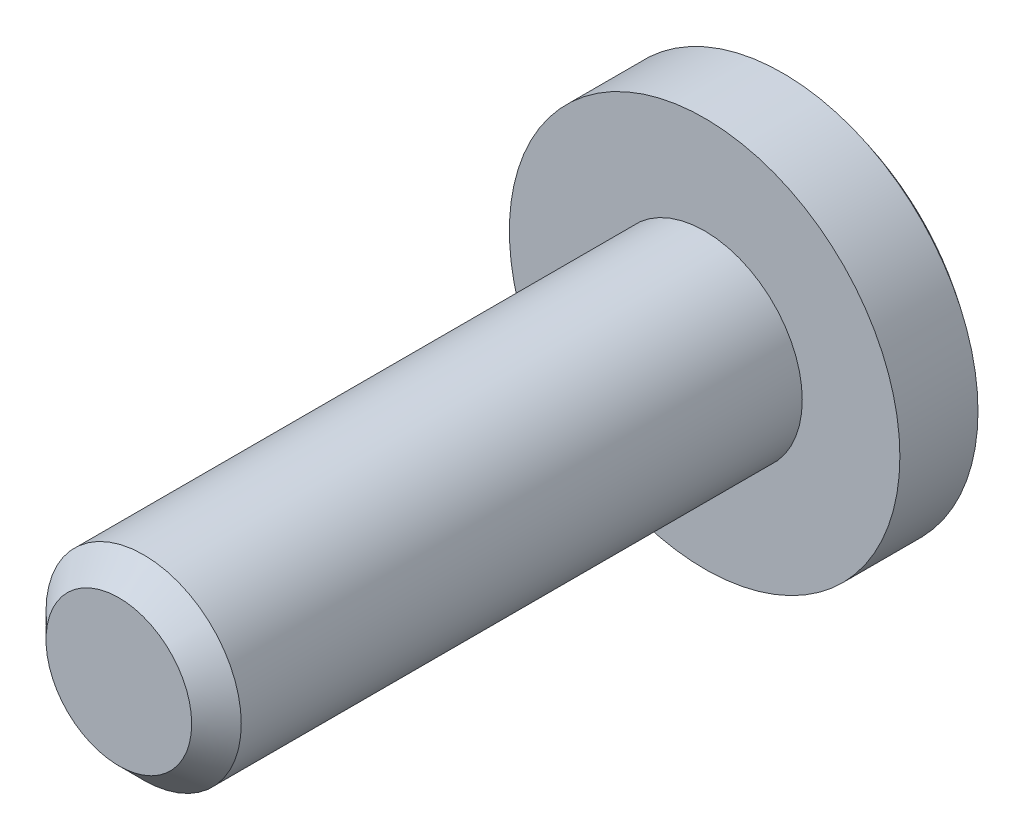
ISO-10303-21;
HEADER;
FILE_DESCRIPTION(('STEP AP214'),'2;1');
FILE_NAME('part.step','',(''),(''),'','','');
FILE_SCHEMA(('AUTOMOTIVE_DESIGN { 1 0 10303 214 1 1 1 1 }'));
ENDSEC;
DATA;
#1=APPLICATION_CONTEXT('core data for automotive mechanical design processes');
#2=APPLICATION_PROTOCOL_DEFINITION('international standard','automotive_design',2000,#1);
#3=PRODUCT_CONTEXT('',#1,'mechanical');
#4=PRODUCT('Part','Part','',(#3));
#5=PRODUCT_RELATED_PRODUCT_CATEGORY('part','',(#4));
#6=PRODUCT_DEFINITION_FORMATION('','',#4);
#7=PRODUCT_DEFINITION_CONTEXT('part definition',#1,'design');
#8=PRODUCT_DEFINITION('design','',#6,#7);
#9=PRODUCT_DEFINITION_SHAPE('','',#8);
#10=(LENGTH_UNIT() NAMED_UNIT(*) SI_UNIT(.MILLI.,.METRE.));
#11=(NAMED_UNIT(*) PLANE_ANGLE_UNIT() SI_UNIT($,.RADIAN.));
#12=(NAMED_UNIT(*) SI_UNIT($,.STERADIAN.) SOLID_ANGLE_UNIT());
#13=UNCERTAINTY_MEASURE_WITH_UNIT(LENGTH_MEASURE(1.E-05),#10,'distance_accuracy_value','');
#14=(GEOMETRIC_REPRESENTATION_CONTEXT(3) GLOBAL_UNCERTAINTY_ASSIGNED_CONTEXT((#13)) GLOBAL_UNIT_ASSIGNED_CONTEXT((#10,
#11,#12)) REPRESENTATION_CONTEXT('',''));
#15=CARTESIAN_POINT('',(0.,0.,0.));
#16=DIRECTION('',(0.,0.,1.));
#17=DIRECTION('',(1.,0.,0.));
#18=AXIS2_PLACEMENT_3D('',#15,#16,#17);
#19=CARTESIAN_POINT('',(0.3,-1.27,-6.8));
#20=DIRECTION('',(1.,0.,0.));
#21=DIRECTION('',(0.,0.,-1.));
#22=AXIS2_PLACEMENT_3D('',#19,#20,#21);
#23=PLANE('',#22);
#24=CARTESIAN_POINT('',(0.3,0.,-4.29285714285715));
#25=DIRECTION('',(1.,0.,0.));
#26=DIRECTION('',(0.,0.,-1.));
#27=AXIS2_PLACEMENT_3D('',#24,#25,#26);
#28=CIRCLE('',#27,3.19308084866675);
#29=CARTESIAN_POINT('',(0.3,1.27,-7.22250990489609));
#30=VERTEX_POINT('',#29);
#31=CARTESIAN_POINT('',(0.3,0.294469512293891,-7.47233084340128));
#32=VERTEX_POINT('',#31);
#33=EDGE_CURVE('E239',#30,#32,#28,.F.);
#34=ORIENTED_EDGE('',*,*,#33,.T.);
#35=DIRECTION('',(0.,0.,1.));
#36=VECTOR('',#35,1.);
#37=CARTESIAN_POINT('',(0.3,0.294469512293891,-6.8));
#38=LINE('',#37,#36);
#39=CARTESIAN_POINT('',(0.3,0.294469512293891,-6.8));
#40=VERTEX_POINT('',#39);
#41=EDGE_CURVE('E182',#32,#40,#38,.T.);
#42=ORIENTED_EDGE('',*,*,#41,.T.);
#43=DIRECTION('',(0.,1.,0.));
#44=VECTOR('',#43,1.);
#45=CARTESIAN_POINT('',(0.3,-1.27,-6.8));
#46=LINE('',#45,#44);
#47=CARTESIAN_POINT('',(0.3,1.27,-6.8));
#48=VERTEX_POINT('',#47);
#49=EDGE_CURVE('E216',#40,#48,#46,.T.);
#50=ORIENTED_EDGE('',*,*,#49,.T.);
#51=DIRECTION('',(0.,0.,-1.));
#52=VECTOR('',#51,1.);
#53=CARTESIAN_POINT('',(0.3,1.27,-6.8));
#54=LINE('',#53,#52);
#55=EDGE_CURVE('E200',#48,#30,#54,.T.);
#56=ORIENTED_EDGE('',*,*,#55,.T.);
#57=EDGE_LOOP('',(#34,#42,#50,#56));
#58=FACE_BOUND('',#57,.T.);
#59=ADVANCED_FACE('F40',(#58),#23,.F.);
#60=CARTESIAN_POINT('',(-0.3,-1.27,-6.8));
#61=DIRECTION('',(-1.,0.,0.));
#62=DIRECTION('',(0.,0.,1.));
#63=AXIS2_PLACEMENT_3D('',#60,#61,#62);
#64=PLANE('',#63);
#65=DIRECTION('',(0.,1.,0.));
#66=VECTOR('',#65,1.);
#67=CARTESIAN_POINT('',(-0.3,-1.27,-6.8));
#68=LINE('',#67,#66);
#69=CARTESIAN_POINT('',(-0.3,0.294469512293891,-6.8));
#70=VERTEX_POINT('',#69);
#71=CARTESIAN_POINT('',(-0.3,1.27,-6.8));
#72=VERTEX_POINT('',#71);
#73=EDGE_CURVE('E199',#70,#72,#68,.T.);
#74=ORIENTED_EDGE('',*,*,#73,.F.);
#75=DIRECTION('',(0.,0.,-1.));
#76=VECTOR('',#75,1.);
#77=CARTESIAN_POINT('',(-0.3,0.294469512293891,-6.8));
#78=LINE('',#77,#76);
#79=CARTESIAN_POINT('',(-0.3,0.294469512293891,-7.47233084340128));
#80=VERTEX_POINT('',#79);
#81=EDGE_CURVE('E250',#70,#80,#78,.T.);
#82=ORIENTED_EDGE('',*,*,#81,.T.);
#83=CARTESIAN_POINT('',(-0.3,0.,-4.29285714285715));
#84=DIRECTION('',(-1.,0.,0.));
#85=DIRECTION('',(0.,0.,1.));
#86=AXIS2_PLACEMENT_3D('',#83,#84,#85);
#87=CIRCLE('',#86,3.19308084866675);
#88=CARTESIAN_POINT('',(-0.3,1.27,-7.22250990489609));
#89=VERTEX_POINT('',#88);
#90=EDGE_CURVE('E233',#80,#89,#87,.F.);
#91=ORIENTED_EDGE('',*,*,#90,.T.);
#92=DIRECTION('',(0.,0.,1.));
#93=VECTOR('',#92,1.);
#94=CARTESIAN_POINT('',(-0.3,1.27,-6.8));
#95=LINE('',#94,#93);
#96=EDGE_CURVE('E204',#89,#72,#95,.T.);
#97=ORIENTED_EDGE('',*,*,#96,.T.);
#98=EDGE_LOOP('',(#74,#82,#91,#97));
#99=FACE_BOUND('',#98,.T.);
#100=ADVANCED_FACE('F276',(#99),#64,.F.);
#101=CARTESIAN_POINT('',(0.,0.,-4.29285714285715));
#102=DIRECTION('',(0.,0.,1.));
#103=DIRECTION('',(1.,0.,0.));
#104=AXIS2_PLACEMENT_3D('',#101,#102,#103);
#105=SPHERICAL_SURFACE('',#104,3.20714285714285);
#106=CARTESIAN_POINT('',(0.,0.294469512293891,-4.29285714285715));
#107=DIRECTION('',(0.,1.,0.));
#108=DIRECTION('',(0.,0.,1.));
#109=AXIS2_PLACEMENT_3D('',#106,#107,#108);
#110=CIRCLE('',#109,3.19359562444148);
#111=CARTESIAN_POINT('',(-1.27,0.294469512293891,-7.22307095970598));
#112=VERTEX_POINT('',#111);
#113=EDGE_CURVE('E179',#112,#80,#110,.F.);
#114=ORIENTED_EDGE('',*,*,#113,.F.);
#115=CARTESIAN_POINT('',(-1.27,0.,-4.29285714285715));
#116=DIRECTION('',(1.,0.,0.));
#117=DIRECTION('',(0.,0.,-1.));
#118=AXIS2_PLACEMENT_3D('',#115,#116,#117);
#119=CIRCLE('',#118,2.94497288716253);
#120=CARTESIAN_POINT('',(-1.27,-0.294469512293891,-7.22307095970598));
#121=VERTEX_POINT('',#120);
#122=EDGE_CURVE('E257',#112,#121,#119,.F.);
#123=ORIENTED_EDGE('',*,*,#122,.T.);
#124=CARTESIAN_POINT('',(0.,-0.294469512293891,-4.29285714285715));
#125=DIRECTION('',(0.,-1.,0.));
#126=DIRECTION('',(0.,0.,-1.));
#127=AXIS2_PLACEMENT_3D('',#124,#125,#126);
#128=CIRCLE('',#127,3.19359562444148);
#129=CARTESIAN_POINT('',(-0.3,-0.294469512293891,-7.47233084340128));
#130=VERTEX_POINT('',#129);
#131=EDGE_CURVE('E146',#130,#121,#128,.F.);
#132=ORIENTED_EDGE('',*,*,#131,.F.);
#133=CARTESIAN_POINT('',(-0.3,-1.27,-7.22250990489609));
#134=VERTEX_POINT('',#133);
#135=EDGE_CURVE('E234',#134,#130,#87,.F.);
#136=ORIENTED_EDGE('',*,*,#135,.F.);
#137=CARTESIAN_POINT('',(0.,-1.27,-4.29285714285715));
#138=DIRECTION('',(0.,1.,0.));
#139=DIRECTION('',(0.,0.,1.));
#140=AXIS2_PLACEMENT_3D('',#137,#138,#139);
#141=CIRCLE('',#140,2.94497288716253);
#142=CARTESIAN_POINT('',(0.3,-1.27,-7.22250990489609));
#143=VERTEX_POINT('',#142);
#144=EDGE_CURVE('E243',#134,#143,#141,.F.);
#145=ORIENTED_EDGE('',*,*,#144,.T.);
#146=CARTESIAN_POINT('',(0.3,-0.294469512293891,-7.47233084340128));
#147=VERTEX_POINT('',#146);
#148=EDGE_CURVE('E238',#147,#143,#28,.F.);
#149=ORIENTED_EDGE('',*,*,#148,.F.);
#150=CARTESIAN_POINT('',(1.27,-0.294469512293891,-7.22307095970598));
#151=VERTEX_POINT('',#150);
#152=EDGE_CURVE('E56',#151,#147,#128,.F.);
#153=ORIENTED_EDGE('',*,*,#152,.F.);
#154=CARTESIAN_POINT('',(1.27,0.,-4.29285714285715));
#155=DIRECTION('',(1.,0.,0.));
#156=DIRECTION('',(0.,0.,-1.));
#157=AXIS2_PLACEMENT_3D('',#154,#155,#156);
#158=CIRCLE('',#157,2.94497288716253);
#159=CARTESIAN_POINT('',(1.27,0.294469512293891,-7.22307095970598));
#160=VERTEX_POINT('',#159);
#161=EDGE_CURVE('E254',#160,#151,#158,.F.);
#162=ORIENTED_EDGE('',*,*,#161,.F.);
#163=EDGE_CURVE('E183',#32,#160,#110,.F.);
#164=ORIENTED_EDGE('',*,*,#163,.F.);
#165=ORIENTED_EDGE('',*,*,#33,.F.);
#166=CARTESIAN_POINT('',(0.,1.27,-4.29285714285715));
#167=DIRECTION('',(0.,1.,0.));
#168=DIRECTION('',(0.,0.,1.));
#169=AXIS2_PLACEMENT_3D('',#166,#167,#168);
#170=CIRCLE('',#169,2.94497288716253);
#171=EDGE_CURVE('E230',#89,#30,#170,.F.);
#172=ORIENTED_EDGE('',*,*,#171,.F.);
#173=ORIENTED_EDGE('',*,*,#90,.F.);
#174=EDGE_LOOP('',(#114,#123,#132,#136,#145,#149,#153,#162,#164,#165,#172,#173));
#175=FACE_BOUND('',#174,.T.);
#176=CARTESIAN_POINT('',(0.,0.,-6.8));
#177=DIRECTION('',(0.,0.,1.));
#178=DIRECTION('',(1.,0.,0.));
#179=AXIS2_PLACEMENT_3D('',#176,#177,#178);
#180=CIRCLE('',#179,2.);
#181=CARTESIAN_POINT('',(2.,0.,-6.8));
#182=VERTEX_POINT('',#181);
#183=EDGE_CURVE('E215',#182,#182,#180,.T.);
#184=ORIENTED_EDGE('',*,*,#183,.F.);
#185=EDGE_LOOP('',(#184));
#186=FACE_BOUND('',#185,.T.);
#187=ADVANCED_FACE('F283',(#175,#186),#105,.T.);
#188=CARTESIAN_POINT('',(0.,0.,0.));
#189=DIRECTION('',(0.,0.,1.));
#190=DIRECTION('',(1.,0.,0.));
#191=AXIS2_PLACEMENT_3D('',#188,#189,#190);
#192=PLANE('',#191);
#193=CARTESIAN_POINT('',(0.,0.,0.));
#194=DIRECTION('',(0.,0.,1.));
#195=DIRECTION('',(1.,0.,0.));
#196=AXIS2_PLACEMENT_3D('',#193,#194,#195);
#197=CIRCLE('',#196,0.746000000000001);
#198=CARTESIAN_POINT('',(0.746000000000001,0.,0.));
#199=VERTEX_POINT('',#198);
#200=EDGE_CURVE('E49',#199,#199,#197,.T.);
#201=ORIENTED_EDGE('',*,*,#200,.T.);
#202=EDGE_LOOP('',(#201));
#203=FACE_BOUND('',#202,.T.);
#204=ADVANCED_FACE('F263',(#203),#192,.T.);
#205=CARTESIAN_POINT('',(0.,0.,0.));
#206=DIRECTION('',(0.,0.,1.));
#207=DIRECTION('',(1.,0.,0.));
#208=AXIS2_PLACEMENT_3D('',#205,#206,#207);
#209=CYLINDRICAL_SURFACE('',#208,1.);
#210=CARTESIAN_POINT('',(0.,0.,-0.254));
#211=DIRECTION('',(0.,0.,1.));
#212=DIRECTION('',(1.,0.,0.));
#213=AXIS2_PLACEMENT_3D('',#210,#211,#212);
#214=CIRCLE('',#213,1.);
#215=CARTESIAN_POINT('',(1.,0.,-0.254));
#216=VERTEX_POINT('',#215);
#217=EDGE_CURVE('E11',#216,#216,#214,.F.);
#218=ORIENTED_EDGE('',*,*,#217,.T.);
#219=EDGE_LOOP('',(#218));
#220=FACE_BOUND('',#219,.T.);
#221=CARTESIAN_POINT('',(0.,0.,-6.));
#222=DIRECTION('',(0.,0.,1.));
#223=DIRECTION('',(1.,0.,0.));
#224=AXIS2_PLACEMENT_3D('',#221,#222,#223);
#225=CIRCLE('',#224,1.);
#226=CARTESIAN_POINT('',(1.,0.,-6.));
#227=VERTEX_POINT('',#226);
#228=EDGE_CURVE('E226',#227,#227,#225,.T.);
#229=ORIENTED_EDGE('',*,*,#228,.T.);
#230=EDGE_LOOP('',(#229));
#231=FACE_BOUND('',#230,.T.);
#232=ADVANCED_FACE('F372',(#220,#231),#209,.T.);
#233=CARTESIAN_POINT('',(1.,0.,-6.));
#234=DIRECTION('',(0.,0.,1.));
#235=DIRECTION('',(1.,0.,0.));
#236=AXIS2_PLACEMENT_3D('',#233,#234,#235);
#237=PLANE('',#236);
#238=CARTESIAN_POINT('',(0.,0.,-6.));
#239=DIRECTION('',(0.,0.,1.));
#240=DIRECTION('',(1.,0.,0.));
#241=AXIS2_PLACEMENT_3D('',#238,#239,#240);
#242=CIRCLE('',#241,2.);
#243=CARTESIAN_POINT('',(2.,0.,-6.));
#244=VERTEX_POINT('',#243);
#245=EDGE_CURVE('E222',#244,#244,#242,.T.);
#246=ORIENTED_EDGE('',*,*,#245,.T.);
#247=EDGE_LOOP('',(#246));
#248=FACE_BOUND('',#247,.T.);
#249=ORIENTED_EDGE('',*,*,#228,.F.);
#250=EDGE_LOOP('',(#249));
#251=FACE_BOUND('',#250,.T.);
#252=ADVANCED_FACE('F296',(#248,#251),#237,.T.);
#253=CARTESIAN_POINT('',(0.,0.,0.));
#254=DIRECTION('',(0.,0.,1.));
#255=DIRECTION('',(1.,0.,0.));
#256=AXIS2_PLACEMENT_3D('',#253,#254,#255);
#257=CYLINDRICAL_SURFACE('',#256,2.);
#258=ORIENTED_EDGE('',*,*,#183,.T.);
#259=EDGE_LOOP('',(#258));
#260=FACE_BOUND('',#259,.T.);
#261=ORIENTED_EDGE('',*,*,#245,.F.);
#262=EDGE_LOOP('',(#261));
#263=FACE_BOUND('',#262,.T.);
#264=ADVANCED_FACE('F289',(#260,#263),#257,.T.);
#265=CARTESIAN_POINT('',(0.3,-1.27,-6.8));
#266=VERTEX_POINT('',#265);
#267=CARTESIAN_POINT('',(0.3,-0.294469512293891,-6.8));
#268=VERTEX_POINT('',#267);
#269=EDGE_CURVE('E211',#266,#268,#46,.T.);
#270=ORIENTED_EDGE('',*,*,#269,.T.);
#271=DIRECTION('',(0.,0.,-1.));
#272=VECTOR('',#271,1.);
#273=CARTESIAN_POINT('',(0.3,-0.294469512293891,-6.8));
#274=LINE('',#273,#272);
#275=EDGE_CURVE('E176',#268,#147,#274,.T.);
#276=ORIENTED_EDGE('',*,*,#275,.T.);
#277=ORIENTED_EDGE('',*,*,#148,.T.);
#278=DIRECTION('',(0.,0.,-1.));
#279=VECTOR('',#278,1.);
#280=CARTESIAN_POINT('',(0.3,-1.27,-6.8));
#281=LINE('',#280,#279);
#282=EDGE_CURVE('E187',#266,#143,#281,.T.);
#283=ORIENTED_EDGE('',*,*,#282,.F.);
#284=EDGE_LOOP('',(#270,#276,#277,#283));
#285=FACE_BOUND('',#284,.T.);
#286=ADVANCED_FACE('F279',(#285),#23,.F.);
#287=CARTESIAN_POINT('',(0.3,-1.27,-6.8));
#288=DIRECTION('',(0.,0.,1.));
#289=DIRECTION('',(1.,0.,0.));
#290=AXIS2_PLACEMENT_3D('',#287,#288,#289);
#291=PLANE('',#290);
#292=CARTESIAN_POINT('',(-0.3,-1.27,-6.8));
#293=VERTEX_POINT('',#292);
#294=CARTESIAN_POINT('',(-0.3,-0.294469512293891,-6.8));
#295=VERTEX_POINT('',#294);
#296=EDGE_CURVE('E137',#293,#295,#68,.T.);
#297=ORIENTED_EDGE('',*,*,#296,.T.);
#298=DIRECTION('',(1.,0.,0.));
#299=VECTOR('',#298,1.);
#300=CARTESIAN_POINT('',(-1.27,-0.294469512293891,-6.8));
#301=LINE('',#300,#299);
#302=CARTESIAN_POINT('',(-1.27,-0.294469512293891,-6.8));
#303=VERTEX_POINT('',#302);
#304=EDGE_CURVE('E64',#303,#295,#301,.T.);
#305=ORIENTED_EDGE('',*,*,#304,.F.);
#306=DIRECTION('',(0.,-1.,0.));
#307=VECTOR('',#306,1.);
#308=CARTESIAN_POINT('',(-1.27,0.294469512293891,-6.8));
#309=LINE('',#308,#307);
#310=CARTESIAN_POINT('',(-1.27,0.294469512293891,-6.8));
#311=VERTEX_POINT('',#310);
#312=EDGE_CURVE('E134',#311,#303,#309,.T.);
#313=ORIENTED_EDGE('',*,*,#312,.F.);
#314=DIRECTION('',(1.,0.,0.));
#315=VECTOR('',#314,1.);
#316=CARTESIAN_POINT('',(-1.27,0.294469512293891,-6.8));
#317=LINE('',#316,#315);
#318=EDGE_CURVE('E171',#311,#70,#317,.T.);
#319=ORIENTED_EDGE('',*,*,#318,.T.);
#320=ORIENTED_EDGE('',*,*,#73,.T.);
#321=DIRECTION('',(1.,0.,0.));
#322=VECTOR('',#321,1.);
#323=CARTESIAN_POINT('',(0.3,1.27,-6.8));
#324=LINE('',#323,#322);
#325=EDGE_CURVE('E192',#72,#48,#324,.T.);
#326=ORIENTED_EDGE('',*,*,#325,.T.);
#327=ORIENTED_EDGE('',*,*,#49,.F.);
#328=CARTESIAN_POINT('',(1.27,0.294469512293891,-6.8));
#329=VERTEX_POINT('',#328);
#330=EDGE_CURVE('E139',#40,#329,#317,.T.);
#331=ORIENTED_EDGE('',*,*,#330,.T.);
#332=DIRECTION('',(0.,-1.,0.));
#333=VECTOR('',#332,1.);
#334=CARTESIAN_POINT('',(1.27,0.294469512293891,-6.8));
#335=LINE('',#334,#333);
#336=CARTESIAN_POINT('',(1.27,-0.294469512293891,-6.8));
#337=VERTEX_POINT('',#336);
#338=EDGE_CURVE('E165',#329,#337,#335,.T.);
#339=ORIENTED_EDGE('',*,*,#338,.T.);
#340=EDGE_CURVE('E140',#268,#337,#301,.T.);
#341=ORIENTED_EDGE('',*,*,#340,.F.);
#342=ORIENTED_EDGE('',*,*,#269,.F.);
#343=DIRECTION('',(1.,0.,0.));
#344=VECTOR('',#343,1.);
#345=CARTESIAN_POINT('',(0.3,-1.27,-6.8));
#346=LINE('',#345,#344);
#347=EDGE_CURVE('E195',#293,#266,#346,.T.);
#348=ORIENTED_EDGE('',*,*,#347,.F.);
#349=EDGE_LOOP('',(#297,#305,#313,#319,#320,#326,#327,#331,#339,#341,#342,#348));
#350=FACE_BOUND('',#349,.T.);
#351=ADVANCED_FACE('F131',(#350),#291,.F.);
#352=ORIENTED_EDGE('',*,*,#135,.T.);
#353=DIRECTION('',(0.,0.,1.));
#354=VECTOR('',#353,1.);
#355=CARTESIAN_POINT('',(-0.3,-0.294469512293891,-6.8));
#356=LINE('',#355,#354);
#357=EDGE_CURVE('E247',#130,#295,#356,.T.);
#358=ORIENTED_EDGE('',*,*,#357,.T.);
#359=ORIENTED_EDGE('',*,*,#296,.F.);
#360=DIRECTION('',(0.,0.,1.));
#361=VECTOR('',#360,1.);
#362=CARTESIAN_POINT('',(-0.3,-1.27,-6.8));
#363=LINE('',#362,#361);
#364=EDGE_CURVE('E191',#134,#293,#363,.T.);
#365=ORIENTED_EDGE('',*,*,#364,.F.);
#366=EDGE_LOOP('',(#352,#358,#359,#365));
#367=FACE_BOUND('',#366,.T.);
#368=ADVANCED_FACE('F286',(#367),#64,.F.);
#369=CARTESIAN_POINT('',(0.3,-1.27,-8.31845680738049));
#370=DIRECTION('',(0.,1.,0.));
#371=DIRECTION('',(0.,0.,1.));
#372=AXIS2_PLACEMENT_3D('',#369,#370,#371);
#373=PLANE('',#372);
#374=ORIENTED_EDGE('',*,*,#364,.T.);
#375=ORIENTED_EDGE('',*,*,#347,.T.);
#376=ORIENTED_EDGE('',*,*,#282,.T.);
#377=ORIENTED_EDGE('',*,*,#144,.F.);
#378=EDGE_LOOP('',(#374,#375,#376,#377));
#379=FACE_BOUND('',#378,.T.);
#380=ADVANCED_FACE('F314',(#379),#373,.T.);
#381=CARTESIAN_POINT('',(0.3,1.27,-8.31845680738049));
#382=DIRECTION('',(0.,1.,0.));
#383=DIRECTION('',(0.,0.,1.));
#384=AXIS2_PLACEMENT_3D('',#381,#382,#383);
#385=PLANE('',#384);
#386=ORIENTED_EDGE('',*,*,#171,.T.);
#387=ORIENTED_EDGE('',*,*,#55,.F.);
#388=ORIENTED_EDGE('',*,*,#325,.F.);
#389=ORIENTED_EDGE('',*,*,#96,.F.);
#390=EDGE_LOOP('',(#386,#387,#388,#389));
#391=FACE_BOUND('',#390,.T.);
#392=ADVANCED_FACE('F324',(#391),#385,.F.);
#393=CARTESIAN_POINT('',(-1.27,0.294469512293891,-6.8));
#394=DIRECTION('',(0.,1.,0.));
#395=DIRECTION('',(0.,0.,1.));
#396=AXIS2_PLACEMENT_3D('',#393,#394,#395);
#397=PLANE('',#396);
#398=ORIENTED_EDGE('',*,*,#113,.T.);
#399=ORIENTED_EDGE('',*,*,#81,.F.);
#400=ORIENTED_EDGE('',*,*,#318,.F.);
#401=DIRECTION('',(0.,0.,1.));
#402=VECTOR('',#401,1.);
#403=CARTESIAN_POINT('',(-1.27,0.294469512293891,-6.8));
#404=LINE('',#403,#402);
#405=EDGE_CURVE('E150',#112,#311,#404,.T.);
#406=ORIENTED_EDGE('',*,*,#405,.F.);
#407=EDGE_LOOP('',(#398,#399,#400,#406));
#408=FACE_BOUND('',#407,.T.);
#409=ADVANCED_FACE('F328',(#408),#397,.F.);
#410=CARTESIAN_POINT('',(-1.27,-0.294469512293891,-6.8));
#411=DIRECTION('',(0.,-1.,0.));
#412=DIRECTION('',(0.,0.,-1.));
#413=AXIS2_PLACEMENT_3D('',#410,#411,#412);
#414=PLANE('',#413);
#415=ORIENTED_EDGE('',*,*,#131,.T.);
#416=DIRECTION('',(0.,0.,-1.));
#417=VECTOR('',#416,1.);
#418=CARTESIAN_POINT('',(-1.27,-0.294469512293891,-6.8));
#419=LINE('',#418,#417);
#420=EDGE_CURVE('E143',#303,#121,#419,.T.);
#421=ORIENTED_EDGE('',*,*,#420,.F.);
#422=ORIENTED_EDGE('',*,*,#304,.T.);
#423=ORIENTED_EDGE('',*,*,#357,.F.);
#424=EDGE_LOOP('',(#415,#421,#422,#423));
#425=FACE_BOUND('',#424,.T.);
#426=ADVANCED_FACE('F144',(#425),#414,.F.);
#427=CARTESIAN_POINT('',(-1.27,-0.294469512293891,-6.8));
#428=DIRECTION('',(1.,0.,0.));
#429=DIRECTION('',(0.,0.,-1.));
#430=AXIS2_PLACEMENT_3D('',#427,#428,#429);
#431=PLANE('',#430);
#432=ORIENTED_EDGE('',*,*,#405,.T.);
#433=ORIENTED_EDGE('',*,*,#312,.T.);
#434=ORIENTED_EDGE('',*,*,#420,.T.);
#435=ORIENTED_EDGE('',*,*,#122,.F.);
#436=EDGE_LOOP('',(#432,#433,#434,#435));
#437=FACE_BOUND('',#436,.T.);
#438=ADVANCED_FACE('F152',(#437),#431,.T.);
#439=ORIENTED_EDGE('',*,*,#163,.T.);
#440=DIRECTION('',(0.,0.,1.));
#441=VECTOR('',#440,1.);
#442=CARTESIAN_POINT('',(1.27,0.294469512293891,-6.8));
#443=LINE('',#442,#441);
#444=EDGE_CURVE('E156',#160,#329,#443,.T.);
#445=ORIENTED_EDGE('',*,*,#444,.T.);
#446=ORIENTED_EDGE('',*,*,#330,.F.);
#447=ORIENTED_EDGE('',*,*,#41,.F.);
#448=EDGE_LOOP('',(#439,#445,#446,#447));
#449=FACE_BOUND('',#448,.T.);
#450=ADVANCED_FACE('F335',(#449),#397,.F.);
#451=ORIENTED_EDGE('',*,*,#152,.T.);
#452=ORIENTED_EDGE('',*,*,#275,.F.);
#453=ORIENTED_EDGE('',*,*,#340,.T.);
#454=DIRECTION('',(0.,0.,-1.));
#455=VECTOR('',#454,1.);
#456=CARTESIAN_POINT('',(1.27,-0.294469512293891,-6.8));
#457=LINE('',#456,#455);
#458=EDGE_CURVE('E160',#337,#151,#457,.T.);
#459=ORIENTED_EDGE('',*,*,#458,.T.);
#460=EDGE_LOOP('',(#451,#452,#453,#459));
#461=FACE_BOUND('',#460,.T.);
#462=ADVANCED_FACE('F271',(#461),#414,.F.);
#463=CARTESIAN_POINT('',(1.27,-0.294469512293891,-6.8));
#464=DIRECTION('',(1.,0.,0.));
#465=DIRECTION('',(0.,0.,-1.));
#466=AXIS2_PLACEMENT_3D('',#463,#464,#465);
#467=PLANE('',#466);
#468=ORIENTED_EDGE('',*,*,#161,.T.);
#469=ORIENTED_EDGE('',*,*,#458,.F.);
#470=ORIENTED_EDGE('',*,*,#338,.F.);
#471=ORIENTED_EDGE('',*,*,#444,.F.);
#472=EDGE_LOOP('',(#468,#469,#470,#471));
#473=FACE_BOUND('',#472,.T.);
#474=ADVANCED_FACE('F266',(#473),#467,.F.);
#475=CARTESIAN_POINT('',(0.,0.,0.));
#476=DIRECTION('',(0.,0.,-1.));
#477=DIRECTION('',(-1.,0.,0.));
#478=AXIS2_PLACEMENT_3D('',#475,#476,#477);
#479=CONICAL_SURFACE('',#478,0.746000000000001,0.785398163397447);
#480=ORIENTED_EDGE('',*,*,#217,.F.);
#481=EDGE_LOOP('',(#480));
#482=FACE_BOUND('',#481,.T.);
#483=ORIENTED_EDGE('',*,*,#200,.F.);
#484=EDGE_LOOP('',(#483));
#485=FACE_BOUND('',#484,.T.);
#486=ADVANCED_FACE('F42',(#482,#485),#479,.T.);
#487=CLOSED_SHELL('',(#59,#100,#187,#204,#232,#252,#264,#286,#351,#368,#380,#392,#409,#426,#438,
#450,#462,#474,#486));
#488=MANIFOLD_SOLID_BREP('B2',#487);
#489=ADVANCED_BREP_SHAPE_REPRESENTATION('',(#18,#488),#14);
#490=SHAPE_DEFINITION_REPRESENTATION(#9,#489);
ENDSEC;
END-ISO-10303-21;
